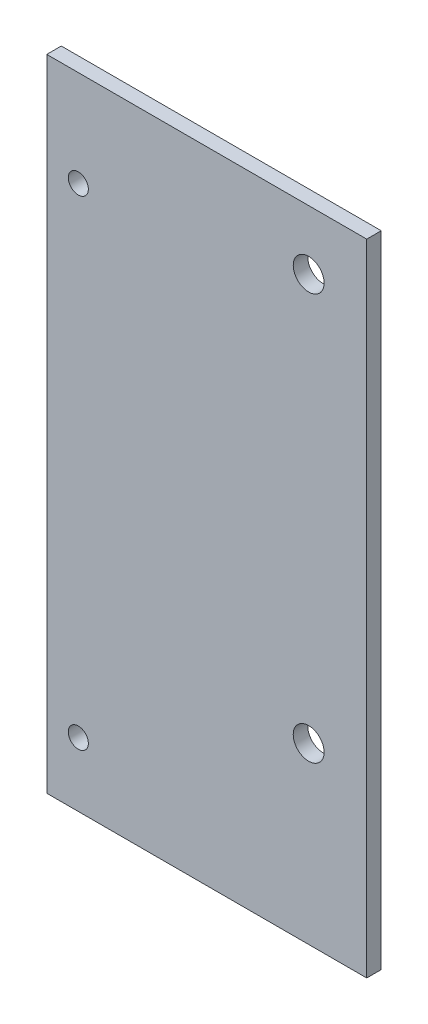
ISO-10303-21;
HEADER;
FILE_DESCRIPTION(('STEP AP214'),'2;1');
FILE_NAME('part.step','',(''),(''),'','','');
FILE_SCHEMA(('AUTOMOTIVE_DESIGN { 1 0 10303 214 1 1 1 1 }'));
ENDSEC;
DATA;
#1=APPLICATION_CONTEXT('core data for automotive mechanical design processes');
#2=APPLICATION_PROTOCOL_DEFINITION('international standard','automotive_design',2000,#1);
#3=PRODUCT_CONTEXT('',#1,'mechanical');
#4=PRODUCT('Part','Part','',(#3));
#5=PRODUCT_RELATED_PRODUCT_CATEGORY('part','',(#4));
#6=PRODUCT_DEFINITION_FORMATION('','',#4);
#7=PRODUCT_DEFINITION_CONTEXT('part definition',#1,'design');
#8=PRODUCT_DEFINITION('design','',#6,#7);
#9=PRODUCT_DEFINITION_SHAPE('','',#8);
#10=(LENGTH_UNIT() NAMED_UNIT(*) SI_UNIT(.MILLI.,.METRE.));
#11=(NAMED_UNIT(*) PLANE_ANGLE_UNIT() SI_UNIT($,.RADIAN.));
#12=(NAMED_UNIT(*) SI_UNIT($,.STERADIAN.) SOLID_ANGLE_UNIT());
#13=UNCERTAINTY_MEASURE_WITH_UNIT(LENGTH_MEASURE(1.E-05),#10,'distance_accuracy_value','');
#14=(GEOMETRIC_REPRESENTATION_CONTEXT(3) GLOBAL_UNCERTAINTY_ASSIGNED_CONTEXT((#13)) GLOBAL_UNIT_ASSIGNED_CONTEXT((#10,
#11,#12)) REPRESENTATION_CONTEXT('',''));
#15=CARTESIAN_POINT('',(0.,0.,0.));
#16=DIRECTION('',(0.,0.,1.));
#17=DIRECTION('',(1.,0.,0.));
#18=AXIS2_PLACEMENT_3D('',#15,#16,#17);
#19=CARTESIAN_POINT('',(0.,0.,3.175));
#20=DIRECTION('',(1.,0.,0.));
#21=DIRECTION('',(0.,0.,-1.));
#22=AXIS2_PLACEMENT_3D('',#19,#20,#21);
#23=PLANE('',#22);
#24=DIRECTION('',(0.,-1.,0.));
#25=VECTOR('',#24,1.);
#26=CARTESIAN_POINT('',(0.,0.,0.));
#27=LINE('',#26,#25);
#28=CARTESIAN_POINT('',(0.,140.,0.));
#29=VERTEX_POINT('',#28);
#30=CARTESIAN_POINT('',(0.,0.,0.));
#31=VERTEX_POINT('',#30);
#32=EDGE_CURVE('E95',#29,#31,#27,.T.);
#33=ORIENTED_EDGE('',*,*,#32,.T.);
#34=DIRECTION('',(0.,0.,-1.));
#35=VECTOR('',#34,1.);
#36=CARTESIAN_POINT('',(0.,0.,3.175));
#37=LINE('',#36,#35);
#38=CARTESIAN_POINT('',(0.,0.,3.175));
#39=VERTEX_POINT('',#38);
#40=EDGE_CURVE('E11',#39,#31,#37,.T.);
#41=ORIENTED_EDGE('',*,*,#40,.F.);
#42=DIRECTION('',(0.,-1.,0.));
#43=VECTOR('',#42,1.);
#44=CARTESIAN_POINT('',(0.,0.,3.175));
#45=LINE('',#44,#43);
#46=CARTESIAN_POINT('',(0.,140.,3.175));
#47=VERTEX_POINT('',#46);
#48=EDGE_CURVE('E83',#47,#39,#45,.T.);
#49=ORIENTED_EDGE('',*,*,#48,.F.);
#50=DIRECTION('',(0.,0.,-1.));
#51=VECTOR('',#50,1.);
#52=CARTESIAN_POINT('',(0.,140.,3.175));
#53=LINE('',#52,#51);
#54=EDGE_CURVE('E91',#47,#29,#53,.T.);
#55=ORIENTED_EDGE('',*,*,#54,.T.);
#56=EDGE_LOOP('',(#33,#41,#49,#55));
#57=FACE_BOUND('',#56,.T.);
#58=ADVANCED_FACE('F32',(#57),#23,.F.);
#59=CARTESIAN_POINT('',(0.,0.,3.175));
#60=DIRECTION('',(0.,1.,0.));
#61=DIRECTION('',(0.,0.,1.));
#62=AXIS2_PLACEMENT_3D('',#59,#60,#61);
#63=PLANE('',#62);
#64=DIRECTION('',(1.,0.,0.));
#65=VECTOR('',#64,1.);
#66=CARTESIAN_POINT('',(0.,0.,0.));
#67=LINE('',#66,#65);
#68=CARTESIAN_POINT('',(70.,0.,0.));
#69=VERTEX_POINT('',#68);
#70=EDGE_CURVE('E87',#31,#69,#67,.T.);
#71=ORIENTED_EDGE('',*,*,#70,.T.);
#72=DIRECTION('',(0.,0.,-1.));
#73=VECTOR('',#72,1.);
#74=CARTESIAN_POINT('',(70.,0.,3.175));
#75=LINE('',#74,#73);
#76=CARTESIAN_POINT('',(70.,0.,3.175));
#77=VERTEX_POINT('',#76);
#78=EDGE_CURVE('E40',#77,#69,#75,.T.);
#79=ORIENTED_EDGE('',*,*,#78,.F.);
#80=DIRECTION('',(1.,0.,0.));
#81=VECTOR('',#80,1.);
#82=CARTESIAN_POINT('',(0.,0.,3.175));
#83=LINE('',#82,#81);
#84=EDGE_CURVE('E78',#39,#77,#83,.T.);
#85=ORIENTED_EDGE('',*,*,#84,.F.);
#86=ORIENTED_EDGE('',*,*,#40,.T.);
#87=EDGE_LOOP('',(#71,#79,#85,#86));
#88=FACE_BOUND('',#87,.T.);
#89=ADVANCED_FACE('F86',(#88),#63,.F.);
#90=CARTESIAN_POINT('',(70.,0.,3.175));
#91=DIRECTION('',(-1.,0.,0.));
#92=DIRECTION('',(0.,0.,1.));
#93=AXIS2_PLACEMENT_3D('',#90,#91,#92);
#94=PLANE('',#93);
#95=DIRECTION('',(0.,1.,0.));
#96=VECTOR('',#95,1.);
#97=CARTESIAN_POINT('',(70.,0.,0.));
#98=LINE('',#97,#96);
#99=CARTESIAN_POINT('',(70.,140.,0.));
#100=VERTEX_POINT('',#99);
#101=EDGE_CURVE('E65',#69,#100,#98,.T.);
#102=ORIENTED_EDGE('',*,*,#101,.T.);
#103=DIRECTION('',(0.,0.,-1.));
#104=VECTOR('',#103,1.);
#105=CARTESIAN_POINT('',(70.,140.,3.175));
#106=LINE('',#105,#104);
#107=CARTESIAN_POINT('',(70.,140.,3.175));
#108=VERTEX_POINT('',#107);
#109=EDGE_CURVE('E88',#108,#100,#106,.T.);
#110=ORIENTED_EDGE('',*,*,#109,.F.);
#111=DIRECTION('',(0.,1.,0.));
#112=VECTOR('',#111,1.);
#113=CARTESIAN_POINT('',(70.,0.,3.175));
#114=LINE('',#113,#112);
#115=EDGE_CURVE('E81',#77,#108,#114,.T.);
#116=ORIENTED_EDGE('',*,*,#115,.F.);
#117=ORIENTED_EDGE('',*,*,#78,.T.);
#118=EDGE_LOOP('',(#102,#110,#116,#117));
#119=FACE_BOUND('',#118,.T.);
#120=ADVANCED_FACE('F89',(#119),#94,.F.);
#121=CARTESIAN_POINT('',(0.,140.,3.175));
#122=DIRECTION('',(0.,-1.,0.));
#123=DIRECTION('',(0.,0.,-1.));
#124=AXIS2_PLACEMENT_3D('',#121,#122,#123);
#125=PLANE('',#124);
#126=DIRECTION('',(-1.,0.,0.));
#127=VECTOR('',#126,1.);
#128=CARTESIAN_POINT('',(0.,140.,0.));
#129=LINE('',#128,#127);
#130=EDGE_CURVE('E71',#100,#29,#129,.T.);
#131=ORIENTED_EDGE('',*,*,#130,.T.);
#132=ORIENTED_EDGE('',*,*,#54,.F.);
#133=DIRECTION('',(-1.,0.,0.));
#134=VECTOR('',#133,1.);
#135=CARTESIAN_POINT('',(0.,140.,3.175));
#136=LINE('',#135,#134);
#137=EDGE_CURVE('E48',#108,#47,#136,.T.);
#138=ORIENTED_EDGE('',*,*,#137,.F.);
#139=ORIENTED_EDGE('',*,*,#109,.T.);
#140=EDGE_LOOP('',(#131,#132,#138,#139));
#141=FACE_BOUND('',#140,.T.);
#142=ADVANCED_FACE('F103',(#141),#125,.F.);
#143=CARTESIAN_POINT('',(0.,0.,3.175));
#144=DIRECTION('',(0.,0.,-1.));
#145=DIRECTION('',(-1.,0.,0.));
#146=AXIS2_PLACEMENT_3D('',#143,#144,#145);
#147=PLANE('',#146);
#148=CARTESIAN_POINT('',(57.3000000000003,127.,3.175));
#149=DIRECTION('',(0.,0.,-1.));
#150=DIRECTION('',(-1.,0.,0.));
#151=AXIS2_PLACEMENT_3D('',#148,#149,#150);
#152=CIRCLE('',#151,3.3782);
#153=CARTESIAN_POINT('',(53.9218000000003,127.,3.175));
#154=VERTEX_POINT('',#153);
#155=EDGE_CURVE('E112',#154,#154,#152,.T.);
#156=ORIENTED_EDGE('',*,*,#155,.T.);
#157=EDGE_LOOP('',(#156));
#158=FACE_BOUND('',#157,.T.);
#159=CARTESIAN_POINT('',(57.3000000000003,38.1,3.175));
#160=DIRECTION('',(0.,0.,-1.));
#161=DIRECTION('',(-1.,0.,0.));
#162=AXIS2_PLACEMENT_3D('',#159,#160,#161);
#163=CIRCLE('',#162,3.37820000000001);
#164=CARTESIAN_POINT('',(53.9218000000003,38.1,3.175));
#165=VERTEX_POINT('',#164);
#166=EDGE_CURVE('E124',#165,#165,#163,.T.);
#167=ORIENTED_EDGE('',*,*,#166,.T.);
#168=EDGE_LOOP('',(#167));
#169=FACE_BOUND('',#168,.T.);
#170=CARTESIAN_POINT('',(6.90000000000038,14.,3.175));
#171=DIRECTION('',(0.,0.,-1.));
#172=DIRECTION('',(-1.,0.,0.));
#173=AXIS2_PLACEMENT_3D('',#170,#171,#172);
#174=CIRCLE('',#173,2.2);
#175=CARTESIAN_POINT('',(4.70000000000038,14.,3.175));
#176=VERTEX_POINT('',#175);
#177=EDGE_CURVE('E118',#176,#176,#174,.T.);
#178=ORIENTED_EDGE('',*,*,#177,.T.);
#179=EDGE_LOOP('',(#178));
#180=FACE_BOUND('',#179,.T.);
#181=CARTESIAN_POINT('',(6.90000000000041,119.,3.175));
#182=DIRECTION('',(0.,0.,-1.));
#183=DIRECTION('',(-1.,0.,0.));
#184=AXIS2_PLACEMENT_3D('',#181,#182,#183);
#185=CIRCLE('',#184,2.20000000000001);
#186=CARTESIAN_POINT('',(4.70000000000039,119.,3.175));
#187=VERTEX_POINT('',#186);
#188=EDGE_CURVE('E98',#187,#187,#185,.T.);
#189=ORIENTED_EDGE('',*,*,#188,.T.);
#190=EDGE_LOOP('',(#189));
#191=FACE_BOUND('',#190,.T.);
#192=ORIENTED_EDGE('',*,*,#48,.T.);
#193=ORIENTED_EDGE('',*,*,#84,.T.);
#194=ORIENTED_EDGE('',*,*,#115,.T.);
#195=ORIENTED_EDGE('',*,*,#137,.T.);
#196=EDGE_LOOP('',(#192,#193,#194,#195));
#197=FACE_BOUND('',#196,.T.);
#198=ADVANCED_FACE('F79',(#158,#169,#180,#191,#197),#147,.F.);
#199=CARTESIAN_POINT('',(0.,0.,0.));
#200=DIRECTION('',(0.,0.,-1.));
#201=DIRECTION('',(-1.,0.,0.));
#202=AXIS2_PLACEMENT_3D('',#199,#200,#201);
#203=PLANE('',#202);
#204=CARTESIAN_POINT('',(57.3000000000003,127.,0.));
#205=DIRECTION('',(0.,0.,-1.));
#206=DIRECTION('',(-1.,0.,0.));
#207=AXIS2_PLACEMENT_3D('',#204,#205,#206);
#208=CIRCLE('',#207,3.3782);
#209=CARTESIAN_POINT('',(53.9218000000003,127.,0.));
#210=VERTEX_POINT('',#209);
#211=EDGE_CURVE('E127',#210,#210,#208,.T.);
#212=ORIENTED_EDGE('',*,*,#211,.F.);
#213=EDGE_LOOP('',(#212));
#214=FACE_BOUND('',#213,.T.);
#215=CARTESIAN_POINT('',(57.3000000000003,38.1,0.));
#216=DIRECTION('',(0.,0.,-1.));
#217=DIRECTION('',(-1.,0.,0.));
#218=AXIS2_PLACEMENT_3D('',#215,#216,#217);
#219=CIRCLE('',#218,3.37820000000001);
#220=CARTESIAN_POINT('',(53.9218000000003,38.1,0.));
#221=VERTEX_POINT('',#220);
#222=EDGE_CURVE('E121',#221,#221,#219,.T.);
#223=ORIENTED_EDGE('',*,*,#222,.F.);
#224=EDGE_LOOP('',(#223));
#225=FACE_BOUND('',#224,.T.);
#226=CARTESIAN_POINT('',(6.90000000000038,14.,0.));
#227=DIRECTION('',(0.,0.,-1.));
#228=DIRECTION('',(-1.,0.,0.));
#229=AXIS2_PLACEMENT_3D('',#226,#227,#228);
#230=CIRCLE('',#229,2.2);
#231=CARTESIAN_POINT('',(4.70000000000038,14.,0.));
#232=VERTEX_POINT('',#231);
#233=EDGE_CURVE('E115',#232,#232,#230,.T.);
#234=ORIENTED_EDGE('',*,*,#233,.F.);
#235=EDGE_LOOP('',(#234));
#236=FACE_BOUND('',#235,.T.);
#237=CARTESIAN_POINT('',(6.90000000000041,119.,0.));
#238=DIRECTION('',(0.,0.,-1.));
#239=DIRECTION('',(-1.,0.,0.));
#240=AXIS2_PLACEMENT_3D('',#237,#238,#239);
#241=CIRCLE('',#240,2.20000000000001);
#242=CARTESIAN_POINT('',(4.70000000000039,119.,0.));
#243=VERTEX_POINT('',#242);
#244=EDGE_CURVE('E109',#243,#243,#241,.T.);
#245=ORIENTED_EDGE('',*,*,#244,.F.);
#246=EDGE_LOOP('',(#245));
#247=FACE_BOUND('',#246,.T.);
#248=ORIENTED_EDGE('',*,*,#32,.F.);
#249=ORIENTED_EDGE('',*,*,#130,.F.);
#250=ORIENTED_EDGE('',*,*,#101,.F.);
#251=ORIENTED_EDGE('',*,*,#70,.F.);
#252=EDGE_LOOP('',(#248,#249,#250,#251));
#253=FACE_BOUND('',#252,.T.);
#254=ADVANCED_FACE('F106',(#214,#225,#236,#247,#253),#203,.T.);
#255=CARTESIAN_POINT('',(6.90000000000041,119.,3.175));
#256=DIRECTION('',(0.,0.,-1.));
#257=DIRECTION('',(-1.,0.,0.));
#258=AXIS2_PLACEMENT_3D('',#255,#256,#257);
#259=CYLINDRICAL_SURFACE('',#258,2.20000000000001);
#260=ORIENTED_EDGE('',*,*,#188,.F.);
#261=EDGE_LOOP('',(#260));
#262=FACE_BOUND('',#261,.T.);
#263=ORIENTED_EDGE('',*,*,#244,.T.);
#264=EDGE_LOOP('',(#263));
#265=FACE_BOUND('',#264,.T.);
#266=ADVANCED_FACE('F144',(#262,#265),#259,.F.);
#267=CARTESIAN_POINT('',(6.90000000000038,14.,3.175));
#268=DIRECTION('',(0.,0.,-1.));
#269=DIRECTION('',(-1.,0.,0.));
#270=AXIS2_PLACEMENT_3D('',#267,#268,#269);
#271=CYLINDRICAL_SURFACE('',#270,2.2);
#272=ORIENTED_EDGE('',*,*,#177,.F.);
#273=EDGE_LOOP('',(#272));
#274=FACE_BOUND('',#273,.T.);
#275=ORIENTED_EDGE('',*,*,#233,.T.);
#276=EDGE_LOOP('',(#275));
#277=FACE_BOUND('',#276,.T.);
#278=ADVANCED_FACE('F153',(#274,#277),#271,.F.);
#279=CARTESIAN_POINT('',(57.3000000000003,38.1,3.175));
#280=DIRECTION('',(0.,0.,-1.));
#281=DIRECTION('',(-1.,0.,0.));
#282=AXIS2_PLACEMENT_3D('',#279,#280,#281);
#283=CYLINDRICAL_SURFACE('',#282,3.37820000000001);
#284=ORIENTED_EDGE('',*,*,#166,.F.);
#285=EDGE_LOOP('',(#284));
#286=FACE_BOUND('',#285,.T.);
#287=ORIENTED_EDGE('',*,*,#222,.T.);
#288=EDGE_LOOP('',(#287));
#289=FACE_BOUND('',#288,.T.);
#290=ADVANCED_FACE('F138',(#286,#289),#283,.F.);
#291=CARTESIAN_POINT('',(57.3000000000003,127.,3.175));
#292=DIRECTION('',(0.,0.,-1.));
#293=DIRECTION('',(-1.,0.,0.));
#294=AXIS2_PLACEMENT_3D('',#291,#292,#293);
#295=CYLINDRICAL_SURFACE('',#294,3.3782);
#296=ORIENTED_EDGE('',*,*,#155,.F.);
#297=EDGE_LOOP('',(#296));
#298=FACE_BOUND('',#297,.T.);
#299=ORIENTED_EDGE('',*,*,#211,.T.);
#300=EDGE_LOOP('',(#299));
#301=FACE_BOUND('',#300,.T.);
#302=ADVANCED_FACE('F135',(#298,#301),#295,.F.);
#303=CLOSED_SHELL('',(#58,#89,#120,#142,#198,#254,#266,#278,#290,#302));
#304=MANIFOLD_SOLID_BREP('B2',#303);
#305=ADVANCED_BREP_SHAPE_REPRESENTATION('',(#18,#304),#14);
#306=SHAPE_DEFINITION_REPRESENTATION(#9,#305);
ENDSEC;
END-ISO-10303-21;
